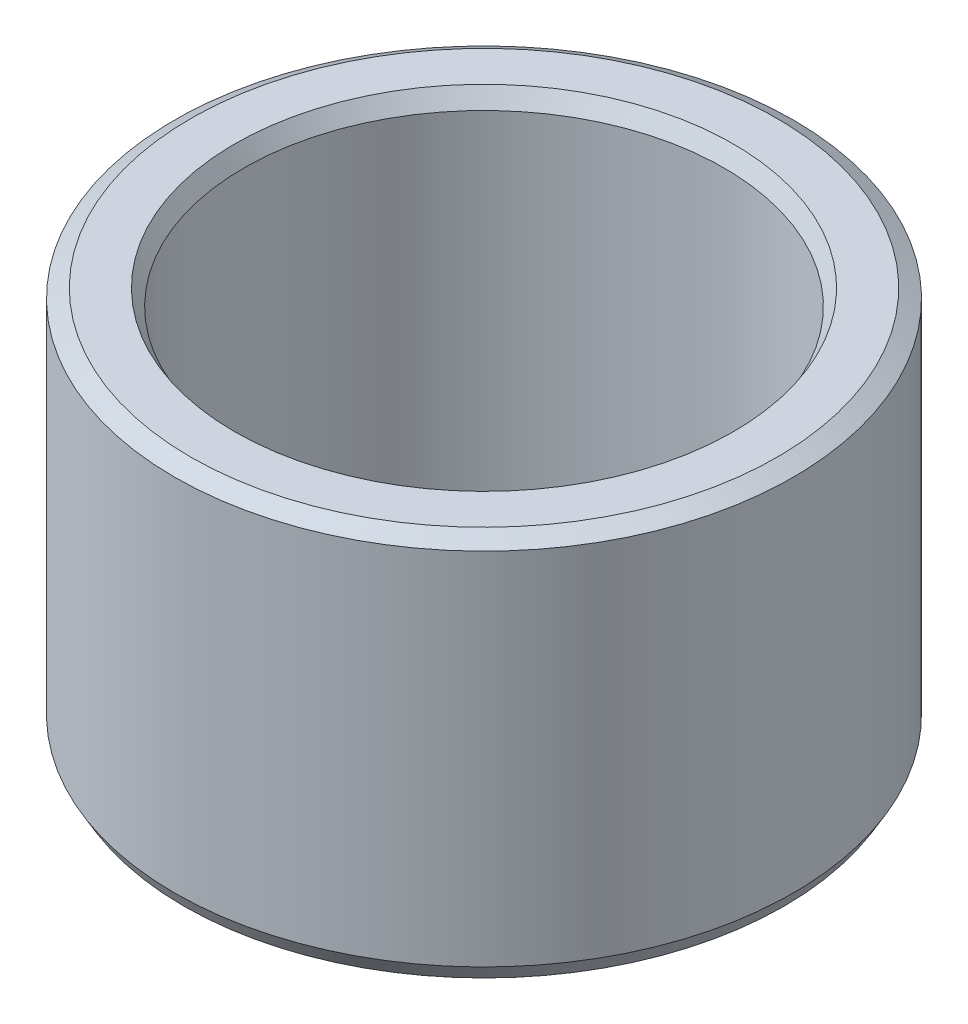
ISO-10303-21;
HEADER;
FILE_DESCRIPTION(('STEP AP214'),'2;1');
FILE_NAME('part.step','',(''),(''),'','','');
FILE_SCHEMA(('AUTOMOTIVE_DESIGN { 1 0 10303 214 1 1 1 1 }'));
ENDSEC;
DATA;
#1=APPLICATION_CONTEXT('core data for automotive mechanical design processes');
#2=APPLICATION_PROTOCOL_DEFINITION('international standard','automotive_design',2000,#1);
#3=PRODUCT_CONTEXT('',#1,'mechanical');
#4=PRODUCT('Part','Part','',(#3));
#5=PRODUCT_RELATED_PRODUCT_CATEGORY('part','',(#4));
#6=PRODUCT_DEFINITION_FORMATION('','',#4);
#7=PRODUCT_DEFINITION_CONTEXT('part definition',#1,'design');
#8=PRODUCT_DEFINITION('design','',#6,#7);
#9=PRODUCT_DEFINITION_SHAPE('','',#8);
#10=(LENGTH_UNIT() NAMED_UNIT(*) SI_UNIT(.MILLI.,.METRE.));
#11=(NAMED_UNIT(*) PLANE_ANGLE_UNIT() SI_UNIT($,.RADIAN.));
#12=(NAMED_UNIT(*) SI_UNIT($,.STERADIAN.) SOLID_ANGLE_UNIT());
#13=UNCERTAINTY_MEASURE_WITH_UNIT(LENGTH_MEASURE(1.E-05),#10,'distance_accuracy_value','');
#14=(GEOMETRIC_REPRESENTATION_CONTEXT(3) GLOBAL_UNCERTAINTY_ASSIGNED_CONTEXT((#13)) GLOBAL_UNIT_ASSIGNED_CONTEXT((#10,
#11,#12)) REPRESENTATION_CONTEXT('',''));
#15=CARTESIAN_POINT('',(0.,0.,0.));
#16=DIRECTION('',(0.,0.,1.));
#17=DIRECTION('',(1.,0.,0.));
#18=AXIS2_PLACEMENT_3D('',#15,#16,#17);
#19=CARTESIAN_POINT('',(0.,43.6123555226145,0.));
#20=DIRECTION('',(0.,-1.,0.));
#21=DIRECTION('',(0.,0.,-1.));
#22=AXIS2_PLACEMENT_3D('',#19,#20,#21);
#23=CYLINDRICAL_SURFACE('',#22,35.);
#24=CARTESIAN_POINT('',(0.,1.82414166355077,0.));
#25=DIRECTION('',(0.,1.,0.));
#26=DIRECTION('',(0.,0.,1.));
#27=AXIS2_PLACEMENT_3D('',#24,#25,#26);
#28=CIRCLE('',#27,35.);
#29=CARTESIAN_POINT('',(0.,1.82414166355077,35.));
#30=VERTEX_POINT('',#29);
#31=EDGE_CURVE('E10',#30,#30,#28,.T.);
#32=ORIENTED_EDGE('',*,*,#31,.T.);
#33=EDGE_LOOP('',(#32));
#34=FACE_BOUND('',#33,.T.);
#35=CARTESIAN_POINT('',(0.,42.5591868421234,0.));
#36=DIRECTION('',(0.,1.,0.));
#37=DIRECTION('',(0.,0.,1.));
#38=AXIS2_PLACEMENT_3D('',#35,#36,#37);
#39=CIRCLE('',#38,35.);
#40=CARTESIAN_POINT('',(0.,42.5591868421234,35.));
#41=VERTEX_POINT('',#40);
#42=EDGE_CURVE('E50',#41,#41,#39,.F.);
#43=ORIENTED_EDGE('',*,*,#42,.T.);
#44=EDGE_LOOP('',(#43));
#45=FACE_BOUND('',#44,.T.);
#46=ADVANCED_FACE('F39',(#34,#45),#23,.T.);
#47=CARTESIAN_POINT('',(0.,43.6123555226145,0.));
#48=DIRECTION('',(0.,1.,0.));
#49=DIRECTION('',(0.,0.,1.));
#50=AXIS2_PLACEMENT_3D('',#47,#48,#49);
#51=PLANE('',#50);
#52=CARTESIAN_POINT('',(0.,43.6123555226145,0.));
#53=DIRECTION('',(0.,1.,0.));
#54=DIRECTION('',(0.,0.,1.));
#55=AXIS2_PLACEMENT_3D('',#52,#53,#54);
#56=CIRCLE('',#55,28.2049907929189);
#57=CARTESIAN_POINT('',(0.,43.6123555226145,28.2049907929189));
#58=VERTEX_POINT('',#57);
#59=EDGE_CURVE('E58',#58,#58,#56,.F.);
#60=ORIENTED_EDGE('',*,*,#59,.T.);
#61=EDGE_LOOP('',(#60));
#62=FACE_BOUND('',#61,.T.);
#63=CARTESIAN_POINT('',(0.,43.6123555226145,0.));
#64=DIRECTION('',(0.,1.,0.));
#65=DIRECTION('',(0.,0.,1.));
#66=AXIS2_PLACEMENT_3D('',#63,#64,#65);
#67=CIRCLE('',#66,33.1758583364492);
#68=CARTESIAN_POINT('',(0.,43.6123555226145,33.1758583364492));
#69=VERTEX_POINT('',#68);
#70=EDGE_CURVE('E61',#69,#69,#67,.T.);
#71=ORIENTED_EDGE('',*,*,#70,.T.);
#72=EDGE_LOOP('',(#71));
#73=FACE_BOUND('',#72,.T.);
#74=ADVANCED_FACE('F88',(#62,#73),#51,.T.);
#75=CARTESIAN_POINT('',(0.,0.,0.));
#76=DIRECTION('',(0.,1.,0.));
#77=DIRECTION('',(0.,0.,1.));
#78=AXIS2_PLACEMENT_3D('',#75,#76,#77);
#79=PLANE('',#78);
#80=CARTESIAN_POINT('',(0.,0.,0.));
#81=DIRECTION('',(0.,1.,0.));
#82=DIRECTION('',(0.,0.,1.));
#83=AXIS2_PLACEMENT_3D('',#80,#81,#82);
#84=CIRCLE('',#83,28.9759637759787);
#85=CARTESIAN_POINT('',(0.,0.,28.9759637759787));
#86=VERTEX_POINT('',#85);
#87=EDGE_CURVE('E51',#86,#86,#84,.T.);
#88=ORIENTED_EDGE('',*,*,#87,.T.);
#89=EDGE_LOOP('',(#88));
#90=FACE_BOUND('',#89,.T.);
#91=CARTESIAN_POINT('',(0.,0.,0.));
#92=DIRECTION('',(0.,1.,0.));
#93=DIRECTION('',(0.,0.,1.));
#94=AXIS2_PLACEMENT_3D('',#91,#92,#93);
#95=CIRCLE('',#94,33.946831319509);
#96=CARTESIAN_POINT('',(0.,0.,33.946831319509));
#97=VERTEX_POINT('',#96);
#98=EDGE_CURVE('E54',#97,#97,#95,.F.);
#99=ORIENTED_EDGE('',*,*,#98,.T.);
#100=EDGE_LOOP('',(#99));
#101=FACE_BOUND('',#100,.T.);
#102=ADVANCED_FACE('F83',(#90,#101),#79,.F.);
#103=CARTESIAN_POINT('',(0.,43.6123555226145,0.));
#104=DIRECTION('',(0.,-1.,0.));
#105=DIRECTION('',(0.,0.,-1.));
#106=AXIS2_PLACEMENT_3D('',#103,#104,#105);
#107=CYLINDRICAL_SURFACE('',#106,27.1518221124279);
#108=CARTESIAN_POINT('',(0.,41.7882138590637,0.));
#109=DIRECTION('',(0.,1.,0.));
#110=DIRECTION('',(0.,0.,1.));
#111=AXIS2_PLACEMENT_3D('',#108,#109,#110);
#112=CIRCLE('',#111,27.1518221124279);
#113=CARTESIAN_POINT('',(0.,41.7882138590637,27.1518221124279));
#114=VERTEX_POINT('',#113);
#115=EDGE_CURVE('E67',#114,#114,#112,.T.);
#116=ORIENTED_EDGE('',*,*,#115,.T.);
#117=EDGE_LOOP('',(#116));
#118=FACE_BOUND('',#117,.T.);
#119=CARTESIAN_POINT('',(0.,1.05316868049108,0.));
#120=DIRECTION('',(0.,1.,0.));
#121=DIRECTION('',(0.,0.,1.));
#122=AXIS2_PLACEMENT_3D('',#119,#120,#121);
#123=CIRCLE('',#122,27.1518221124279);
#124=CARTESIAN_POINT('',(0.,1.05316868049108,27.1518221124279));
#125=VERTEX_POINT('',#124);
#126=EDGE_CURVE('E69',#125,#125,#123,.F.);
#127=ORIENTED_EDGE('',*,*,#126,.T.);
#128=EDGE_LOOP('',(#127));
#129=FACE_BOUND('',#128,.T.);
#130=ADVANCED_FACE('F71',(#118,#129),#107,.F.);
#131=CARTESIAN_POINT('',(0.,41.7882138590637,0.));
#132=DIRECTION('',(0.,1.,0.));
#133=DIRECTION('',(0.,0.,1.));
#134=AXIS2_PLACEMENT_3D('',#131,#132,#133);
#135=CONICAL_SURFACE('',#134,27.1518221124279,0.523598775598307);
#136=ORIENTED_EDGE('',*,*,#59,.F.);
#137=EDGE_LOOP('',(#136));
#138=FACE_BOUND('',#137,.T.);
#139=ORIENTED_EDGE('',*,*,#115,.F.);
#140=EDGE_LOOP('',(#139));
#141=FACE_BOUND('',#140,.T.);
#142=ADVANCED_FACE('F77',(#138,#141),#135,.F.);
#143=CARTESIAN_POINT('',(0.,0.,0.));
#144=DIRECTION('',(0.,-1.,0.));
#145=DIRECTION('',(0.,0.,-1.));
#146=AXIS2_PLACEMENT_3D('',#143,#144,#145);
#147=CONICAL_SURFACE('',#146,28.9759637759787,1.04719755119659);
#148=ORIENTED_EDGE('',*,*,#126,.F.);
#149=EDGE_LOOP('',(#148));
#150=FACE_BOUND('',#149,.T.);
#151=ORIENTED_EDGE('',*,*,#87,.F.);
#152=EDGE_LOOP('',(#151));
#153=FACE_BOUND('',#152,.T.);
#154=ADVANCED_FACE('F73',(#150,#153),#147,.F.);
#155=CARTESIAN_POINT('',(0.,1.82414166355077,0.));
#156=DIRECTION('',(0.,1.,0.));
#157=DIRECTION('',(0.,0.,1.));
#158=AXIS2_PLACEMENT_3D('',#155,#156,#157);
#159=CONICAL_SURFACE('',#158,35.,0.523598775598303);
#160=ORIENTED_EDGE('',*,*,#98,.F.);
#161=EDGE_LOOP('',(#160));
#162=FACE_BOUND('',#161,.T.);
#163=ORIENTED_EDGE('',*,*,#31,.F.);
#164=EDGE_LOOP('',(#163));
#165=FACE_BOUND('',#164,.T.);
#166=ADVANCED_FACE('F76',(#162,#165),#159,.T.);
#167=CARTESIAN_POINT('',(0.,43.6123555226145,0.));
#168=DIRECTION('',(0.,-1.,0.));
#169=DIRECTION('',(0.,0.,-1.));
#170=AXIS2_PLACEMENT_3D('',#167,#168,#169);
#171=CONICAL_SURFACE('',#170,33.1758583364492,1.04719755119659);
#172=ORIENTED_EDGE('',*,*,#42,.F.);
#173=EDGE_LOOP('',(#172));
#174=FACE_BOUND('',#173,.T.);
#175=ORIENTED_EDGE('',*,*,#70,.F.);
#176=EDGE_LOOP('',(#175));
#177=FACE_BOUND('',#176,.T.);
#178=ADVANCED_FACE('F45',(#174,#177),#171,.T.);
#179=CLOSED_SHELL('',(#46,#74,#102,#130,#142,#154,#166,#178));
#180=MANIFOLD_SOLID_BREP('B2',#179);
#181=ADVANCED_BREP_SHAPE_REPRESENTATION('',(#18,#180),#14);
#182=SHAPE_DEFINITION_REPRESENTATION(#9,#181);
ENDSEC;
END-ISO-10303-21;
